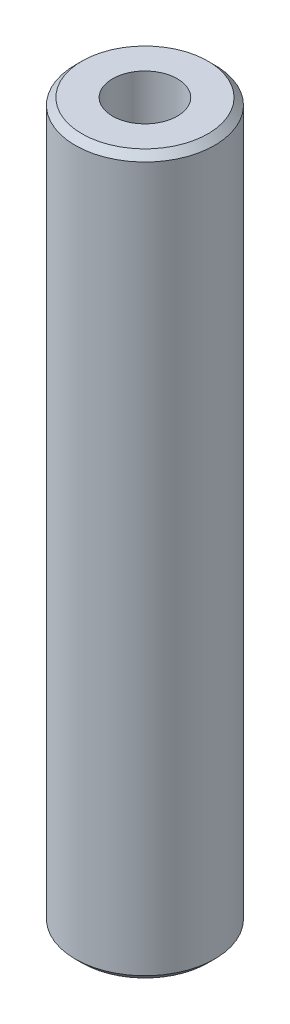
ISO-10303-21;
HEADER;
FILE_DESCRIPTION(('STEP AP214'),'2;1');
FILE_NAME('part.step','',(''),(''),'','','');
FILE_SCHEMA(('AUTOMOTIVE_DESIGN { 1 0 10303 214 1 1 1 1 }'));
ENDSEC;
DATA;
#1=APPLICATION_CONTEXT('core data for automotive mechanical design processes');
#2=APPLICATION_PROTOCOL_DEFINITION('international standard','automotive_design',2000,#1);
#3=PRODUCT_CONTEXT('',#1,'mechanical');
#4=PRODUCT('Part','Part','',(#3));
#5=PRODUCT_RELATED_PRODUCT_CATEGORY('part','',(#4));
#6=PRODUCT_DEFINITION_FORMATION('','',#4);
#7=PRODUCT_DEFINITION_CONTEXT('part definition',#1,'design');
#8=PRODUCT_DEFINITION('design','',#6,#7);
#9=PRODUCT_DEFINITION_SHAPE('','',#8);
#10=(LENGTH_UNIT() NAMED_UNIT(*) SI_UNIT(.MILLI.,.METRE.));
#11=(NAMED_UNIT(*) PLANE_ANGLE_UNIT() SI_UNIT($,.RADIAN.));
#12=(NAMED_UNIT(*) SI_UNIT($,.STERADIAN.) SOLID_ANGLE_UNIT());
#13=UNCERTAINTY_MEASURE_WITH_UNIT(LENGTH_MEASURE(1.E-05),#10,'distance_accuracy_value','');
#14=(GEOMETRIC_REPRESENTATION_CONTEXT(3) GLOBAL_UNCERTAINTY_ASSIGNED_CONTEXT((#13)) GLOBAL_UNIT_ASSIGNED_CONTEXT((#10,
#11,#12)) REPRESENTATION_CONTEXT('',''));
#15=CARTESIAN_POINT('',(0.,0.,0.));
#16=DIRECTION('',(0.,0.,1.));
#17=DIRECTION('',(1.,0.,0.));
#18=AXIS2_PLACEMENT_3D('',#15,#16,#17);
#19=CARTESIAN_POINT('',(0.,592.414431145439,0.));
#20=DIRECTION('',(0.,-1.,0.));
#21=DIRECTION('',(0.,0.,-1.));
#22=AXIS2_PLACEMENT_3D('',#19,#20,#21);
#23=CYLINDRICAL_SURFACE('',#22,57.5);
#24=CARTESIAN_POINT('',(0.,586.900703009108,0.));
#25=DIRECTION('',(0.,1.,0.));
#26=DIRECTION('',(0.,0.,1.));
#27=AXIS2_PLACEMENT_3D('',#24,#25,#26);
#28=CIRCLE('',#27,57.5);
#29=CARTESIAN_POINT('',(0.,586.900703009108,57.5));
#30=VERTEX_POINT('',#29);
#31=EDGE_CURVE('E50',#30,#30,#28,.F.);
#32=ORIENTED_EDGE('',*,*,#31,.T.);
#33=EDGE_LOOP('',(#32));
#34=FACE_BOUND('',#33,.T.);
#35=CARTESIAN_POINT('',(0.,5.51372813633144,0.));
#36=DIRECTION('',(0.,1.,0.));
#37=DIRECTION('',(0.,0.,1.));
#38=AXIS2_PLACEMENT_3D('',#35,#36,#37);
#39=CIRCLE('',#38,57.5);
#40=CARTESIAN_POINT('',(0.,5.51372813633144,57.5));
#41=VERTEX_POINT('',#40);
#42=EDGE_CURVE('E51',#41,#41,#39,.T.);
#43=ORIENTED_EDGE('',*,*,#42,.T.);
#44=EDGE_LOOP('',(#43));
#45=FACE_BOUND('',#44,.T.);
#46=ADVANCED_FACE('F39',(#34,#45),#23,.T.);
#47=CARTESIAN_POINT('',(0.,592.414431145439,0.));
#48=DIRECTION('',(0.,1.,0.));
#49=DIRECTION('',(0.,0.,1.));
#50=AXIS2_PLACEMENT_3D('',#47,#48,#49);
#51=PLANE('',#50);
#52=CARTESIAN_POINT('',(0.,592.414431145439,0.));
#53=DIRECTION('',(0.,1.,0.));
#54=DIRECTION('',(0.,0.,1.));
#55=AXIS2_PLACEMENT_3D('',#52,#53,#54);
#56=CIRCLE('',#55,51.9862718636686);
#57=CARTESIAN_POINT('',(0.,592.414431145439,51.9862718636686));
#58=VERTEX_POINT('',#57);
#59=EDGE_CURVE('E54',#58,#58,#56,.T.);
#60=ORIENTED_EDGE('',*,*,#59,.T.);
#61=EDGE_LOOP('',(#60));
#62=FACE_BOUND('',#61,.T.);
#63=CARTESIAN_POINT('',(0.,592.414431145439,0.));
#64=DIRECTION('',(0.,1.,0.));
#65=DIRECTION('',(0.,0.,1.));
#66=AXIS2_PLACEMENT_3D('',#63,#64,#65);
#67=CIRCLE('',#66,26.7375651743396);
#68=CARTESIAN_POINT('',(0.,592.414431145439,26.7375651743396));
#69=VERTEX_POINT('',#68);
#70=EDGE_CURVE('E58',#69,#69,#67,.T.);
#71=ORIENTED_EDGE('',*,*,#70,.F.);
#72=EDGE_LOOP('',(#71));
#73=FACE_BOUND('',#72,.T.);
#74=ADVANCED_FACE('F69',(#62,#73),#51,.T.);
#75=CARTESIAN_POINT('',(0.,0.,0.));
#76=DIRECTION('',(0.,1.,0.));
#77=DIRECTION('',(0.,0.,1.));
#78=AXIS2_PLACEMENT_3D('',#75,#76,#77);
#79=PLANE('',#78);
#80=CARTESIAN_POINT('',(0.,0.,0.));
#81=DIRECTION('',(0.,1.,0.));
#82=DIRECTION('',(0.,0.,1.));
#83=AXIS2_PLACEMENT_3D('',#80,#81,#82);
#84=CIRCLE('',#83,51.9862718636684);
#85=CARTESIAN_POINT('',(0.,0.,51.9862718636684));
#86=VERTEX_POINT('',#85);
#87=EDGE_CURVE('E10',#86,#86,#84,.F.);
#88=ORIENTED_EDGE('',*,*,#87,.T.);
#89=EDGE_LOOP('',(#88));
#90=FACE_BOUND('',#89,.T.);
#91=CARTESIAN_POINT('',(0.,0.,0.));
#92=DIRECTION('',(0.,1.,0.));
#93=DIRECTION('',(0.,0.,1.));
#94=AXIS2_PLACEMENT_3D('',#91,#92,#93);
#95=CIRCLE('',#94,26.7375651743396);
#96=CARTESIAN_POINT('',(0.,0.,26.7375651743396));
#97=VERTEX_POINT('',#96);
#98=EDGE_CURVE('E63',#97,#97,#95,.T.);
#99=ORIENTED_EDGE('',*,*,#98,.T.);
#100=EDGE_LOOP('',(#99));
#101=FACE_BOUND('',#100,.T.);
#102=ADVANCED_FACE('F75',(#90,#101),#79,.F.);
#103=CARTESIAN_POINT('',(0.,592.414431145439,0.));
#104=DIRECTION('',(0.,-1.,0.));
#105=DIRECTION('',(0.,0.,-1.));
#106=AXIS2_PLACEMENT_3D('',#103,#104,#105);
#107=CYLINDRICAL_SURFACE('',#106,26.7375651743396);
#108=ORIENTED_EDGE('',*,*,#70,.T.);
#109=EDGE_LOOP('',(#108));
#110=FACE_BOUND('',#109,.T.);
#111=ORIENTED_EDGE('',*,*,#98,.F.);
#112=EDGE_LOOP('',(#111));
#113=FACE_BOUND('',#112,.T.);
#114=ADVANCED_FACE('F70',(#110,#113),#107,.F.);
#115=CARTESIAN_POINT('',(0.,592.414431145439,0.));
#116=DIRECTION('',(0.,-1.,0.));
#117=DIRECTION('',(0.,0.,-1.));
#118=AXIS2_PLACEMENT_3D('',#115,#116,#117);
#119=CONICAL_SURFACE('',#118,51.9862718636686,0.785398163397439);
#120=ORIENTED_EDGE('',*,*,#31,.F.);
#121=EDGE_LOOP('',(#120));
#122=FACE_BOUND('',#121,.T.);
#123=ORIENTED_EDGE('',*,*,#59,.F.);
#124=EDGE_LOOP('',(#123));
#125=FACE_BOUND('',#124,.T.);
#126=ADVANCED_FACE('F81',(#122,#125),#119,.T.);
#127=CARTESIAN_POINT('',(0.,5.51372813633144,0.));
#128=DIRECTION('',(0.,1.,0.));
#129=DIRECTION('',(0.,0.,1.));
#130=AXIS2_PLACEMENT_3D('',#127,#128,#129);
#131=CONICAL_SURFACE('',#130,57.5,0.785398163397458);
#132=ORIENTED_EDGE('',*,*,#87,.F.);
#133=EDGE_LOOP('',(#132));
#134=FACE_BOUND('',#133,.T.);
#135=ORIENTED_EDGE('',*,*,#42,.F.);
#136=EDGE_LOOP('',(#135));
#137=FACE_BOUND('',#136,.T.);
#138=ADVANCED_FACE('F45',(#134,#137),#131,.T.);
#139=CLOSED_SHELL('',(#46,#74,#102,#114,#126,#138));
#140=MANIFOLD_SOLID_BREP('B2',#139);
#141=ADVANCED_BREP_SHAPE_REPRESENTATION('',(#18,#140),#14);
#142=SHAPE_DEFINITION_REPRESENTATION(#9,#141);
ENDSEC;
END-ISO-10303-21;
